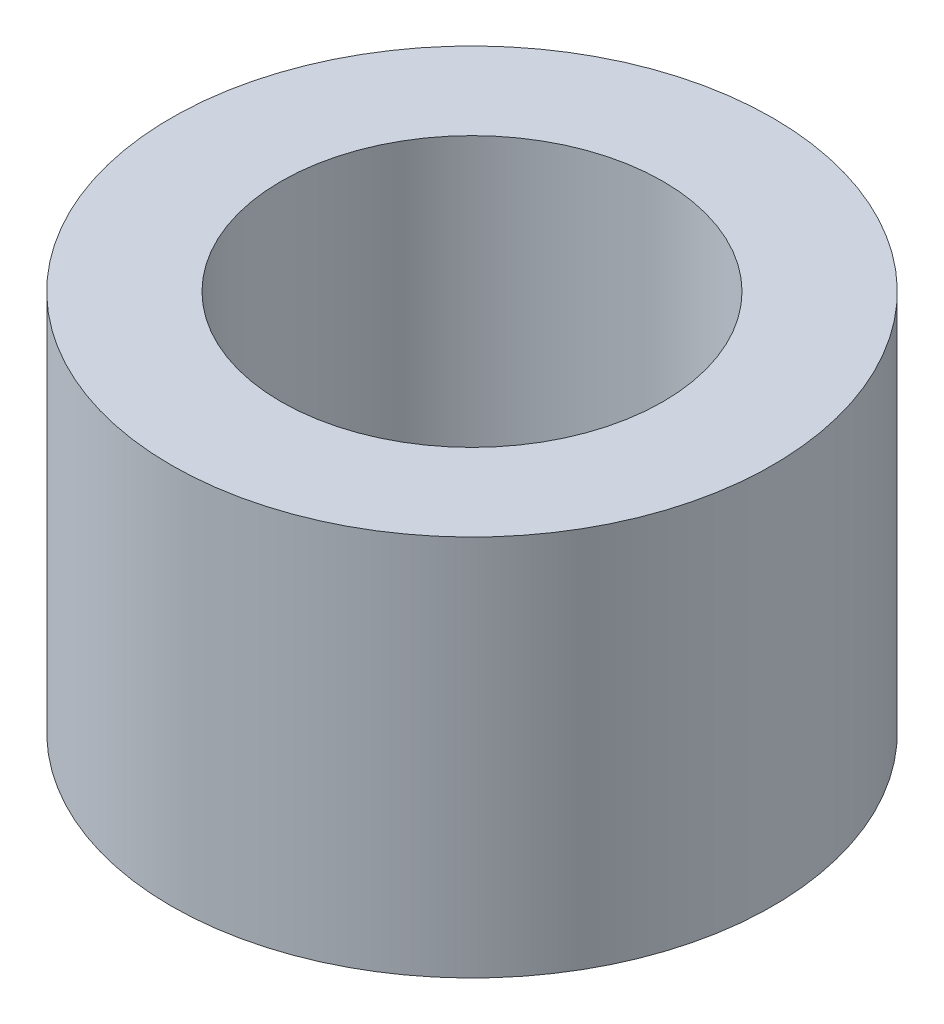
ISO-10303-21;
HEADER;
FILE_DESCRIPTION(('STEP AP214'),'2;1');
FILE_NAME('part.step','',(''),(''),'','','');
FILE_SCHEMA(('AUTOMOTIVE_DESIGN { 1 0 10303 214 1 1 1 1 }'));
ENDSEC;
DATA;
#1=APPLICATION_CONTEXT('core data for automotive mechanical design processes');
#2=APPLICATION_PROTOCOL_DEFINITION('international standard','automotive_design',2000,#1);
#3=PRODUCT_CONTEXT('',#1,'mechanical');
#4=PRODUCT('Part','Part','',(#3));
#5=PRODUCT_RELATED_PRODUCT_CATEGORY('part','',(#4));
#6=PRODUCT_DEFINITION_FORMATION('','',#4);
#7=PRODUCT_DEFINITION_CONTEXT('part definition',#1,'design');
#8=PRODUCT_DEFINITION('design','',#6,#7);
#9=PRODUCT_DEFINITION_SHAPE('','',#8);
#10=(LENGTH_UNIT() NAMED_UNIT(*) SI_UNIT(.MILLI.,.METRE.));
#11=(NAMED_UNIT(*) PLANE_ANGLE_UNIT() SI_UNIT($,.RADIAN.));
#12=(NAMED_UNIT(*) SI_UNIT($,.STERADIAN.) SOLID_ANGLE_UNIT());
#13=UNCERTAINTY_MEASURE_WITH_UNIT(LENGTH_MEASURE(1.E-05),#10,'distance_accuracy_value','');
#14=(GEOMETRIC_REPRESENTATION_CONTEXT(3) GLOBAL_UNCERTAINTY_ASSIGNED_CONTEXT((#13)) GLOBAL_UNIT_ASSIGNED_CONTEXT((#10,
#11,#12)) REPRESENTATION_CONTEXT('',''));
#15=CARTESIAN_POINT('',(0.,0.,0.));
#16=DIRECTION('',(0.,0.,1.));
#17=DIRECTION('',(1.,0.,0.));
#18=AXIS2_PLACEMENT_3D('',#15,#16,#17);
#19=CARTESIAN_POINT('',(2.,4.,0.));
#20=DIRECTION('',(0.,1.,0.));
#21=DIRECTION('',(0.,0.,1.));
#22=AXIS2_PLACEMENT_3D('',#19,#20,#21);
#23=PLANE('',#22);
#24=CARTESIAN_POINT('',(0.,4.,0.));
#25=DIRECTION('',(0.,-1.,0.));
#26=DIRECTION('',(0.,0.,-1.));
#27=AXIS2_PLACEMENT_3D('',#24,#25,#26);
#28=CIRCLE('',#27,2.);
#29=CARTESIAN_POINT('',(0.,4.,-2.));
#30=VERTEX_POINT('',#29);
#31=EDGE_CURVE('E49',#30,#30,#28,.T.);
#32=ORIENTED_EDGE('',*,*,#31,.T.);
#33=EDGE_LOOP('',(#32));
#34=FACE_BOUND('',#33,.T.);
#35=CARTESIAN_POINT('',(0.,4.,0.));
#36=DIRECTION('',(0.,-1.,0.));
#37=DIRECTION('',(0.,0.,-1.));
#38=AXIS2_PLACEMENT_3D('',#35,#36,#37);
#39=CIRCLE('',#38,3.15);
#40=CARTESIAN_POINT('',(0.,4.,-3.15));
#41=VERTEX_POINT('',#40);
#42=EDGE_CURVE('E10',#41,#41,#39,.T.);
#43=ORIENTED_EDGE('',*,*,#42,.F.);
#44=EDGE_LOOP('',(#43));
#45=FACE_BOUND('',#44,.T.);
#46=ADVANCED_FACE('F35',(#34,#45),#23,.T.);
#47=CARTESIAN_POINT('',(0.,0.,0.));
#48=DIRECTION('',(0.,-1.,0.));
#49=DIRECTION('',(0.,0.,-1.));
#50=AXIS2_PLACEMENT_3D('',#47,#48,#49);
#51=CYLINDRICAL_SURFACE('',#50,3.15);
#52=ORIENTED_EDGE('',*,*,#42,.T.);
#53=EDGE_LOOP('',(#52));
#54=FACE_BOUND('',#53,.T.);
#55=CARTESIAN_POINT('',(0.,0.,0.));
#56=DIRECTION('',(0.,-1.,0.));
#57=DIRECTION('',(0.,0.,-1.));
#58=AXIS2_PLACEMENT_3D('',#55,#56,#57);
#59=CIRCLE('',#58,3.15);
#60=CARTESIAN_POINT('',(0.,0.,-3.15));
#61=VERTEX_POINT('',#60);
#62=EDGE_CURVE('E41',#61,#61,#59,.T.);
#63=ORIENTED_EDGE('',*,*,#62,.F.);
#64=EDGE_LOOP('',(#63));
#65=FACE_BOUND('',#64,.T.);
#66=ADVANCED_FACE('F65',(#54,#65),#51,.T.);
#67=CARTESIAN_POINT('',(3.15,0.,0.));
#68=DIRECTION('',(0.,-1.,0.));
#69=DIRECTION('',(0.,0.,-1.));
#70=AXIS2_PLACEMENT_3D('',#67,#68,#69);
#71=PLANE('',#70);
#72=ORIENTED_EDGE('',*,*,#62,.T.);
#73=EDGE_LOOP('',(#72));
#74=FACE_BOUND('',#73,.T.);
#75=CARTESIAN_POINT('',(0.,0.,0.));
#76=DIRECTION('',(0.,-1.,0.));
#77=DIRECTION('',(0.,0.,-1.));
#78=AXIS2_PLACEMENT_3D('',#75,#76,#77);
#79=CIRCLE('',#78,2.);
#80=CARTESIAN_POINT('',(0.,0.,-2.));
#81=VERTEX_POINT('',#80);
#82=EDGE_CURVE('E45',#81,#81,#79,.T.);
#83=ORIENTED_EDGE('',*,*,#82,.F.);
#84=EDGE_LOOP('',(#83));
#85=FACE_BOUND('',#84,.T.);
#86=ADVANCED_FACE('F59',(#74,#85),#71,.T.);
#87=CARTESIAN_POINT('',(0.,0.,0.));
#88=DIRECTION('',(0.,-1.,0.));
#89=DIRECTION('',(0.,0.,-1.));
#90=AXIS2_PLACEMENT_3D('',#87,#88,#89);
#91=CYLINDRICAL_SURFACE('',#90,2.);
#92=ORIENTED_EDGE('',*,*,#82,.T.);
#93=EDGE_LOOP('',(#92));
#94=FACE_BOUND('',#93,.T.);
#95=ORIENTED_EDGE('',*,*,#31,.F.);
#96=EDGE_LOOP('',(#95));
#97=FACE_BOUND('',#96,.T.);
#98=ADVANCED_FACE('F57',(#94,#97),#91,.F.);
#99=CLOSED_SHELL('',(#46,#66,#86,#98));
#100=MANIFOLD_SOLID_BREP('B2',#99);
#101=ADVANCED_BREP_SHAPE_REPRESENTATION('',(#18,#100),#14);
#102=SHAPE_DEFINITION_REPRESENTATION(#9,#101);
ENDSEC;
END-ISO-10303-21;
